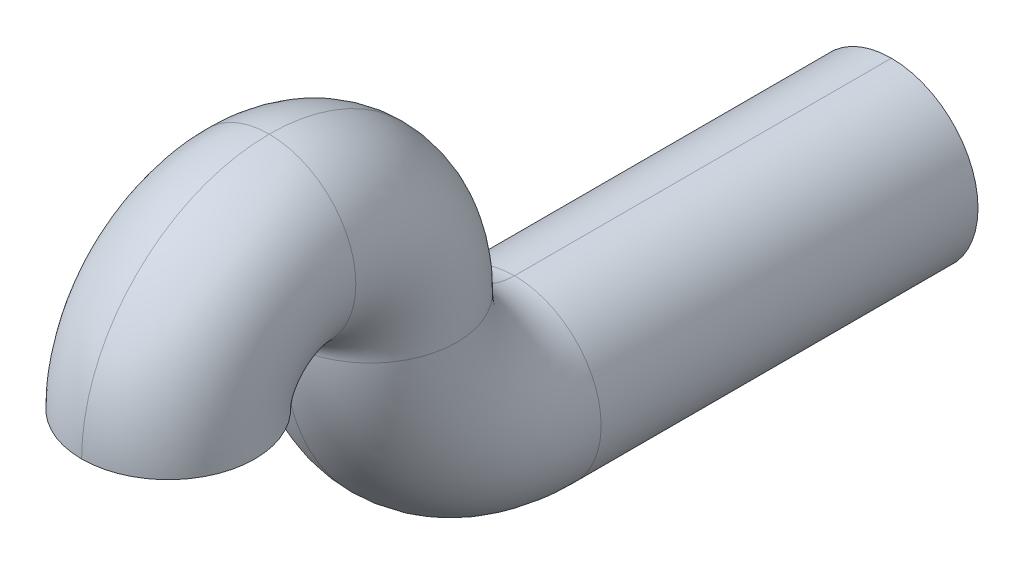
ISO-10303-21;
HEADER;
FILE_DESCRIPTION(('STEP AP214'),'2;1');
FILE_NAME('part.step','',(''),(''),'','','');
FILE_SCHEMA(('AUTOMOTIVE_DESIGN { 1 0 10303 214 1 1 1 1 }'));
ENDSEC;
DATA;
#1=APPLICATION_CONTEXT('core data for automotive mechanical design processes');
#2=APPLICATION_PROTOCOL_DEFINITION('international standard','automotive_design',2000,#1);
#3=PRODUCT_CONTEXT('',#1,'mechanical');
#4=PRODUCT('Part','Part','',(#3));
#5=PRODUCT_RELATED_PRODUCT_CATEGORY('part','',(#4));
#6=PRODUCT_DEFINITION_FORMATION('','',#4);
#7=PRODUCT_DEFINITION_CONTEXT('part definition',#1,'design');
#8=PRODUCT_DEFINITION('design','',#6,#7);
#9=PRODUCT_DEFINITION_SHAPE('','',#8);
#10=(LENGTH_UNIT() NAMED_UNIT(*) SI_UNIT(.MILLI.,.METRE.));
#11=(NAMED_UNIT(*) PLANE_ANGLE_UNIT() SI_UNIT($,.RADIAN.));
#12=(NAMED_UNIT(*) SI_UNIT($,.STERADIAN.) SOLID_ANGLE_UNIT());
#13=UNCERTAINTY_MEASURE_WITH_UNIT(LENGTH_MEASURE(1.E-05),#10,'distance_accuracy_value','');
#14=(GEOMETRIC_REPRESENTATION_CONTEXT(3) GLOBAL_UNCERTAINTY_ASSIGNED_CONTEXT((#13)) GLOBAL_UNIT_ASSIGNED_CONTEXT((#10,
#11,#12)) REPRESENTATION_CONTEXT('',''));
#15=CARTESIAN_POINT('',(0.,0.,0.));
#16=DIRECTION('',(0.,0.,1.));
#17=DIRECTION('',(1.,0.,0.));
#18=AXIS2_PLACEMENT_3D('',#15,#16,#17);
#19=CARTESIAN_POINT('',(100.,120.046296296296,120.));
#20=DIRECTION('',(0.,0.,1.));
#21=DIRECTION('',(0.,-1.,0.));
#22=AXIS2_PLACEMENT_3D('',#19,#20,#21);
#23=CYLINDRICAL_SURFACE('',#22,20.);
#24=DIRECTION('',(0.,0.,1.));
#25=VECTOR('',#24,1.);
#26=CARTESIAN_POINT('',(100.,140.046296296296,120.));
#27=LINE('',#26,#25);
#28=CARTESIAN_POINT('',(100.,140.046296296296,120.));
#29=VERTEX_POINT('',#28);
#30=CARTESIAN_POINT('',(100.,140.046296296296,250.573265730801));
#31=VERTEX_POINT('',#30);
#32=EDGE_CURVE('E158',#29,#31,#27,.T.);
#33=ORIENTED_EDGE('',*,*,#32,.F.);
#34=CARTESIAN_POINT('',(100.,120.046296296296,120.));
#35=DIRECTION('',(0.,0.,1.));
#36=DIRECTION('',(1.,0.,0.));
#37=AXIS2_PLACEMENT_3D('',#34,#35,#36);
#38=CIRCLE('',#37,20.);
#39=CARTESIAN_POINT('',(100.,100.046296296296,120.));
#40=VERTEX_POINT('',#39);
#41=EDGE_CURVE('E10',#40,#29,#38,.T.);
#42=ORIENTED_EDGE('',*,*,#41,.F.);
#43=DIRECTION('',(0.,0.,1.));
#44=VECTOR('',#43,1.);
#45=CARTESIAN_POINT('',(100.,100.046296296296,120.));
#46=LINE('',#45,#44);
#47=CARTESIAN_POINT('',(100.,100.046296296296,250.573265730801));
#48=VERTEX_POINT('',#47);
#49=EDGE_CURVE('E214',#40,#48,#46,.T.);
#50=ORIENTED_EDGE('',*,*,#49,.T.);
#51=CARTESIAN_POINT('',(100.,120.046296296296,250.573265730801));
#52=DIRECTION('',(0.,0.,1.));
#53=DIRECTION('',(-1.,0.,0.));
#54=AXIS2_PLACEMENT_3D('',#51,#52,#53);
#55=CIRCLE('',#54,20.);
#56=EDGE_CURVE('E173',#48,#31,#55,.T.);
#57=ORIENTED_EDGE('',*,*,#56,.T.);
#58=EDGE_LOOP('',(#33,#42,#50,#57));
#59=FACE_BOUND('',#58,.T.);
#60=ADVANCED_FACE('F16',(#59),#23,.F.);
#61=CARTESIAN_POINT('',(100.,170.046296296297,250.573265730801));
#62=DIRECTION('',(-1.,0.,0.));
#63=DIRECTION('',(0.,-1.,0.));
#64=AXIS2_PLACEMENT_3D('',#61,#62,#63);
#65=TOROIDAL_SURFACE('',#64,50.,20.);
#66=CARTESIAN_POINT('',(100.,170.046296296297,250.573265730801));
#67=DIRECTION('',(-1.,0.,0.));
#68=DIRECTION('',(0.,-1.,0.));
#69=AXIS2_PLACEMENT_3D('',#66,#67,#68);
#70=CIRCLE('',#69,70.);
#71=CARTESIAN_POINT('',(100.,170.046296296297,320.573265730801));
#72=VERTEX_POINT('',#71);
#73=EDGE_CURVE('E168',#48,#72,#70,.T.);
#74=ORIENTED_EDGE('',*,*,#73,.F.);
#75=CARTESIAN_POINT('',(100.,120.046296296296,250.573265730801));
#76=DIRECTION('',(0.,0.,1.));
#77=DIRECTION('',(-1.,0.,0.));
#78=AXIS2_PLACEMENT_3D('',#75,#76,#77);
#79=CIRCLE('',#78,20.);
#80=EDGE_CURVE('E210',#31,#48,#79,.T.);
#81=ORIENTED_EDGE('',*,*,#80,.F.);
#82=CARTESIAN_POINT('',(100.,170.046296296297,250.573265730801));
#83=DIRECTION('',(-1.,0.,0.));
#84=DIRECTION('',(0.,-1.,0.));
#85=AXIS2_PLACEMENT_3D('',#82,#83,#84);
#86=CIRCLE('',#85,30.);
#87=CARTESIAN_POINT('',(100.,170.046296296297,280.573265730801));
#88=VERTEX_POINT('',#87);
#89=EDGE_CURVE('E198',#31,#88,#86,.T.);
#90=ORIENTED_EDGE('',*,*,#89,.T.);
#91=CARTESIAN_POINT('',(100.,170.046296296297,300.573265730801));
#92=DIRECTION('',(0.,1.,0.));
#93=DIRECTION('',(0.,0.,-1.));
#94=AXIS2_PLACEMENT_3D('',#91,#92,#93);
#95=CIRCLE('',#94,20.);
#96=EDGE_CURVE('E242',#88,#72,#95,.T.);
#97=ORIENTED_EDGE('',*,*,#96,.T.);
#98=EDGE_LOOP('',(#74,#81,#90,#97));
#99=FACE_BOUND('',#98,.T.);
#100=ADVANCED_FACE('F390',(#99),#65,.F.);
#101=CARTESIAN_POINT('',(100.,170.046296296296,335.573265730801));
#102=DIRECTION('',(1.,0.,0.));
#103=DIRECTION('',(0.,1.,0.));
#104=AXIS2_PLACEMENT_3D('',#101,#102,#103);
#105=TOROIDAL_SURFACE('',#104,35.,20.);
#106=CARTESIAN_POINT('',(100.,170.046296296296,335.573265730801));
#107=DIRECTION('',(1.,0.,0.));
#108=DIRECTION('',(0.,1.,0.));
#109=AXIS2_PLACEMENT_3D('',#106,#107,#108);
#110=CIRCLE('',#109,55.);
#111=CARTESIAN_POINT('',(100.,225.046296296296,335.573265730801));
#112=VERTEX_POINT('',#111);
#113=EDGE_CURVE('E164',#88,#112,#110,.T.);
#114=ORIENTED_EDGE('',*,*,#113,.F.);
#115=CARTESIAN_POINT('',(100.,170.046296296297,300.573265730801));
#116=DIRECTION('',(0.,1.,0.));
#117=DIRECTION('',(0.,0.,-1.));
#118=AXIS2_PLACEMENT_3D('',#115,#116,#117);
#119=CIRCLE('',#118,20.);
#120=EDGE_CURVE('E172',#72,#88,#119,.T.);
#121=ORIENTED_EDGE('',*,*,#120,.F.);
#122=CARTESIAN_POINT('',(100.,170.046296296296,335.573265730801));
#123=DIRECTION('',(1.,0.,0.));
#124=DIRECTION('',(0.,1.,0.));
#125=AXIS2_PLACEMENT_3D('',#122,#123,#124);
#126=CIRCLE('',#125,15.);
#127=CARTESIAN_POINT('',(100.,185.046296296296,335.573265730801));
#128=VERTEX_POINT('',#127);
#129=EDGE_CURVE('E163',#72,#128,#126,.T.);
#130=ORIENTED_EDGE('',*,*,#129,.T.);
#131=CARTESIAN_POINT('',(100.,205.046296296296,335.573265730801));
#132=DIRECTION('',(0.,0.,-1.));
#133=DIRECTION('',(-1.,0.,0.));
#134=AXIS2_PLACEMENT_3D('',#131,#132,#133);
#135=CIRCLE('',#134,20.);
#136=EDGE_CURVE('E179',#112,#128,#135,.T.);
#137=ORIENTED_EDGE('',*,*,#136,.F.);
#138=EDGE_LOOP('',(#114,#121,#130,#137));
#139=FACE_BOUND('',#138,.T.);
#140=ADVANCED_FACE('F407',(#139),#105,.F.);
#141=CARTESIAN_POINT('',(100.,120.046296296296,120.));
#142=DIRECTION('',(0.,0.,1.));
#143=DIRECTION('',(1.,0.,0.));
#144=AXIS2_PLACEMENT_3D('',#141,#142,#143);
#145=PLANE('',#144);
#146=ORIENTED_EDGE('',*,*,#41,.T.);
#147=CARTESIAN_POINT('',(100.,120.046296296296,120.));
#148=DIRECTION('',(0.,0.,1.));
#149=DIRECTION('',(1.,0.,0.));
#150=AXIS2_PLACEMENT_3D('',#147,#148,#149);
#151=CIRCLE('',#150,20.);
#152=EDGE_CURVE('E187',#29,#40,#151,.T.);
#153=ORIENTED_EDGE('',*,*,#152,.T.);
#154=EDGE_LOOP('',(#146,#153));
#155=FACE_BOUND('',#154,.T.);
#156=CARTESIAN_POINT('',(100.,120.046296296296,120.));
#157=DIRECTION('',(0.,0.,1.));
#158=DIRECTION('',(1.,0.,0.));
#159=AXIS2_PLACEMENT_3D('',#156,#157,#158);
#160=CIRCLE('',#159,30.);
#161=CARTESIAN_POINT('',(100.,90.0462962962963,120.));
#162=VERTEX_POINT('',#161);
#163=CARTESIAN_POINT('',(100.,150.046296296297,120.));
#164=VERTEX_POINT('',#163);
#165=EDGE_CURVE('E130',#162,#164,#160,.T.);
#166=ORIENTED_EDGE('',*,*,#165,.F.);
#167=CARTESIAN_POINT('',(100.,120.046296296296,120.));
#168=DIRECTION('',(0.,0.,1.));
#169=DIRECTION('',(1.,0.,0.));
#170=AXIS2_PLACEMENT_3D('',#167,#168,#169);
#171=CIRCLE('',#170,30.);
#172=EDGE_CURVE('E27',#164,#162,#171,.T.);
#173=ORIENTED_EDGE('',*,*,#172,.F.);
#174=EDGE_LOOP('',(#166,#173));
#175=FACE_BOUND('',#174,.T.);
#176=ADVANCED_FACE('F403',(#155,#175),#145,.F.);
#177=CARTESIAN_POINT('',(100.,170.046296296297,370.573265730801));
#178=DIRECTION('',(0.,-1.,0.));
#179=DIRECTION('',(-1.,0.,0.));
#180=AXIS2_PLACEMENT_3D('',#177,#178,#179);
#181=PLANE('',#180);
#182=CARTESIAN_POINT('',(100.,170.046296296297,370.573265730801));
#183=DIRECTION('',(0.,-1.,0.));
#184=DIRECTION('',(0.,0.,-1.));
#185=AXIS2_PLACEMENT_3D('',#182,#183,#184);
#186=CIRCLE('',#185,20.);
#187=CARTESIAN_POINT('',(100.,170.046296296297,350.573265730801));
#188=VERTEX_POINT('',#187);
#189=CARTESIAN_POINT('',(100.,170.046296296297,390.573265730801));
#190=VERTEX_POINT('',#189);
#191=EDGE_CURVE('E182',#188,#190,#186,.T.);
#192=ORIENTED_EDGE('',*,*,#191,.F.);
#193=CARTESIAN_POINT('',(100.,170.046296296297,370.573265730801));
#194=DIRECTION('',(0.,-1.,0.));
#195=DIRECTION('',(0.,0.,-1.));
#196=AXIS2_PLACEMENT_3D('',#193,#194,#195);
#197=CIRCLE('',#196,20.);
#198=EDGE_CURVE('E20',#190,#188,#197,.T.);
#199=ORIENTED_EDGE('',*,*,#198,.F.);
#200=EDGE_LOOP('',(#192,#199));
#201=FACE_BOUND('',#200,.T.);
#202=CARTESIAN_POINT('',(100.,170.046296296297,370.573265730801));
#203=DIRECTION('',(0.,-1.,0.));
#204=DIRECTION('',(1.,0.,0.));
#205=AXIS2_PLACEMENT_3D('',#202,#203,#204);
#206=CIRCLE('',#205,30.);
#207=CARTESIAN_POINT('',(100.,170.046296296297,340.573265730801));
#208=VERTEX_POINT('',#207);
#209=CARTESIAN_POINT('',(100.,170.046296296297,400.573265730801));
#210=VERTEX_POINT('',#209);
#211=EDGE_CURVE('E154',#208,#210,#206,.T.);
#212=ORIENTED_EDGE('',*,*,#211,.T.);
#213=CARTESIAN_POINT('',(100.,170.046296296297,370.573265730801));
#214=DIRECTION('',(0.,-1.,0.));
#215=DIRECTION('',(1.,0.,0.));
#216=AXIS2_PLACEMENT_3D('',#213,#214,#215);
#217=CIRCLE('',#216,30.);
#218=EDGE_CURVE('E165',#210,#208,#217,.T.);
#219=ORIENTED_EDGE('',*,*,#218,.T.);
#220=EDGE_LOOP('',(#212,#219));
#221=FACE_BOUND('',#220,.T.);
#222=ADVANCED_FACE('F18',(#201,#221),#181,.T.);
#223=CARTESIAN_POINT('',(100.,120.046296296296,120.));
#224=DIRECTION('',(0.,0.,1.));
#225=DIRECTION('',(0.,-1.,0.));
#226=AXIS2_PLACEMENT_3D('',#223,#224,#225);
#227=CYLINDRICAL_SURFACE('',#226,30.);
#228=DIRECTION('',(0.,0.,1.));
#229=VECTOR('',#228,1.);
#230=CARTESIAN_POINT('',(100.,150.046296296297,120.));
#231=LINE('',#230,#229);
#232=CARTESIAN_POINT('',(100.,150.046296296296,250.573265730801));
#233=VERTEX_POINT('',#232);
#234=EDGE_CURVE('E126',#164,#233,#231,.T.);
#235=ORIENTED_EDGE('',*,*,#234,.F.);
#236=ORIENTED_EDGE('',*,*,#172,.T.);
#237=DIRECTION('',(0.,0.,1.));
#238=VECTOR('',#237,1.);
#239=CARTESIAN_POINT('',(100.,90.0462962962963,120.));
#240=LINE('',#239,#238);
#241=CARTESIAN_POINT('',(100.,90.0462962962963,250.573265730801));
#242=VERTEX_POINT('',#241);
#243=EDGE_CURVE('E125',#162,#242,#240,.T.);
#244=ORIENTED_EDGE('',*,*,#243,.T.);
#245=CARTESIAN_POINT('',(100.,120.046296296296,250.573265730801));
#246=DIRECTION('',(0.,0.,1.));
#247=DIRECTION('',(1.,0.,0.));
#248=AXIS2_PLACEMENT_3D('',#245,#246,#247);
#249=CIRCLE('',#248,30.);
#250=EDGE_CURVE('E137',#233,#242,#249,.T.);
#251=ORIENTED_EDGE('',*,*,#250,.F.);
#252=EDGE_LOOP('',(#235,#236,#244,#251));
#253=FACE_BOUND('',#252,.T.);
#254=ADVANCED_FACE('F143',(#253),#227,.T.);
#255=CARTESIAN_POINT('',(100.,170.046296296297,250.573265730801));
#256=DIRECTION('',(-1.,0.,0.));
#257=DIRECTION('',(0.,-1.,0.));
#258=AXIS2_PLACEMENT_3D('',#255,#256,#257);
#259=TOROIDAL_SURFACE('',#258,50.,30.);
#260=CARTESIAN_POINT('',(100.,170.046296296297,250.573265730801));
#261=DIRECTION('',(-1.,0.,0.));
#262=DIRECTION('',(0.,-1.,0.));
#263=AXIS2_PLACEMENT_3D('',#260,#261,#262);
#264=CIRCLE('',#263,80.);
#265=CARTESIAN_POINT('',(100.,170.046296296297,330.573265730801));
#266=VERTEX_POINT('',#265);
#267=EDGE_CURVE('E120',#242,#266,#264,.T.);
#268=ORIENTED_EDGE('',*,*,#267,.F.);
#269=CARTESIAN_POINT('',(100.,120.046296296296,250.573265730801));
#270=DIRECTION('',(0.,0.,1.));
#271=DIRECTION('',(1.,0.,0.));
#272=AXIS2_PLACEMENT_3D('',#269,#270,#271);
#273=CIRCLE('',#272,30.);
#274=EDGE_CURVE('E112',#242,#233,#273,.T.);
#275=ORIENTED_EDGE('',*,*,#274,.T.);
#276=CARTESIAN_POINT('',(100.,170.046296296297,250.573265730801));
#277=DIRECTION('',(-1.,0.,0.));
#278=DIRECTION('',(0.,-1.,0.));
#279=AXIS2_PLACEMENT_3D('',#276,#277,#278);
#280=CIRCLE('',#279,20.);
#281=CARTESIAN_POINT('',(100.,170.046296296297,270.573265730801));
#282=VERTEX_POINT('',#281);
#283=EDGE_CURVE('E117',#233,#282,#280,.T.);
#284=ORIENTED_EDGE('',*,*,#283,.T.);
#285=CARTESIAN_POINT('',(100.,170.046296296297,300.573265730801));
#286=DIRECTION('',(0.,1.,0.));
#287=DIRECTION('',(1.,0.,0.));
#288=AXIS2_PLACEMENT_3D('',#285,#286,#287);
#289=CIRCLE('',#288,30.);
#290=EDGE_CURVE('E141',#266,#282,#289,.T.);
#291=ORIENTED_EDGE('',*,*,#290,.F.);
#292=EDGE_LOOP('',(#268,#275,#284,#291));
#293=FACE_BOUND('',#292,.T.);
#294=ADVANCED_FACE('F114',(#293),#259,.T.);
#295=CARTESIAN_POINT('',(100.,170.046296296296,335.573265730801));
#296=DIRECTION('',(1.,0.,0.));
#297=DIRECTION('',(0.,1.,0.));
#298=AXIS2_PLACEMENT_3D('',#295,#296,#297);
#299=TOROIDAL_SURFACE('',#298,35.,30.);
#300=CARTESIAN_POINT('',(100.,170.046296296296,335.573265730801));
#301=DIRECTION('',(1.,0.,0.));
#302=DIRECTION('',(0.,1.,0.));
#303=AXIS2_PLACEMENT_3D('',#300,#301,#302);
#304=CIRCLE('',#303,65.);
#305=CARTESIAN_POINT('',(100.,235.046296296296,335.573265730801));
#306=VERTEX_POINT('',#305);
#307=EDGE_CURVE('E197',#306,#210,#304,.T.);
#308=ORIENTED_EDGE('',*,*,#307,.F.);
#309=CARTESIAN_POINT('',(100.,205.046296296296,335.573265730801));
#310=DIRECTION('',(0.,0.,-1.));
#311=DIRECTION('',(-1.,0.,0.));
#312=AXIS2_PLACEMENT_3D('',#309,#310,#311);
#313=CIRCLE('',#312,30.);
#314=CARTESIAN_POINT('',(100.,175.046296296296,335.573265730801));
#315=VERTEX_POINT('',#314);
#316=EDGE_CURVE('E186',#315,#306,#313,.T.);
#317=ORIENTED_EDGE('',*,*,#316,.F.);
#318=CARTESIAN_POINT('',(100.,170.046296296296,335.573265730801));
#319=DIRECTION('',(1.,0.,0.));
#320=DIRECTION('',(0.,1.,0.));
#321=AXIS2_PLACEMENT_3D('',#318,#319,#320);
#322=CIRCLE('',#321,5.);
#323=EDGE_CURVE('E145',#315,#208,#322,.T.);
#324=ORIENTED_EDGE('',*,*,#323,.T.);
#325=ORIENTED_EDGE('',*,*,#218,.F.);
#326=EDGE_LOOP('',(#308,#317,#324,#325));
#327=FACE_BOUND('',#326,.T.);
#328=ADVANCED_FACE('F398',(#327),#299,.T.);
#329=CARTESIAN_POINT('',(100.,120.046296296296,120.));
#330=DIRECTION('',(0.,0.,1.));
#331=DIRECTION('',(0.,-1.,0.));
#332=AXIS2_PLACEMENT_3D('',#329,#330,#331);
#333=CYLINDRICAL_SURFACE('',#332,30.);
#334=ORIENTED_EDGE('',*,*,#165,.T.);
#335=ORIENTED_EDGE('',*,*,#234,.T.);
#336=ORIENTED_EDGE('',*,*,#274,.F.);
#337=ORIENTED_EDGE('',*,*,#243,.F.);
#338=EDGE_LOOP('',(#334,#335,#336,#337));
#339=FACE_BOUND('',#338,.T.);
#340=ADVANCED_FACE('F129',(#339),#333,.T.);
#341=CARTESIAN_POINT('',(100.,170.046296296296,335.573265730801));
#342=DIRECTION('',(1.,0.,0.));
#343=DIRECTION('',(0.,1.,0.));
#344=AXIS2_PLACEMENT_3D('',#341,#342,#343);
#345=TOROIDAL_SURFACE('',#344,35.,30.);
#346=CARTESIAN_POINT('',(100.,170.046296296296,335.573265730801));
#347=DIRECTION('',(1.,0.,0.));
#348=DIRECTION('',(0.,1.,0.));
#349=AXIS2_PLACEMENT_3D('',#346,#347,#348);
#350=CIRCLE('',#349,65.);
#351=EDGE_CURVE('E238',#282,#306,#350,.T.);
#352=ORIENTED_EDGE('',*,*,#351,.F.);
#353=CARTESIAN_POINT('',(100.,170.046296296297,300.573265730801));
#354=DIRECTION('',(0.,1.,0.));
#355=DIRECTION('',(1.,0.,0.));
#356=AXIS2_PLACEMENT_3D('',#353,#354,#355);
#357=CIRCLE('',#356,30.);
#358=EDGE_CURVE('E139',#282,#266,#357,.T.);
#359=ORIENTED_EDGE('',*,*,#358,.T.);
#360=CARTESIAN_POINT('',(100.,170.046296296296,335.573265730801));
#361=DIRECTION('',(1.,0.,0.));
#362=DIRECTION('',(0.,1.,0.));
#363=AXIS2_PLACEMENT_3D('',#360,#361,#362);
#364=CIRCLE('',#363,5.);
#365=EDGE_CURVE('E178',#266,#315,#364,.T.);
#366=ORIENTED_EDGE('',*,*,#365,.T.);
#367=ORIENTED_EDGE('',*,*,#316,.T.);
#368=EDGE_LOOP('',(#352,#359,#366,#367));
#369=FACE_BOUND('',#368,.T.);
#370=ADVANCED_FACE('F416',(#369),#345,.T.);
#371=CARTESIAN_POINT('',(100.,120.046296296296,120.));
#372=DIRECTION('',(0.,0.,1.));
#373=DIRECTION('',(0.,-1.,0.));
#374=AXIS2_PLACEMENT_3D('',#371,#372,#373);
#375=CYLINDRICAL_SURFACE('',#374,20.);
#376=ORIENTED_EDGE('',*,*,#152,.F.);
#377=ORIENTED_EDGE('',*,*,#32,.T.);
#378=ORIENTED_EDGE('',*,*,#80,.T.);
#379=ORIENTED_EDGE('',*,*,#49,.F.);
#380=EDGE_LOOP('',(#376,#377,#378,#379));
#381=FACE_BOUND('',#380,.T.);
#382=ADVANCED_FACE('F432',(#381),#375,.F.);
#383=CARTESIAN_POINT('',(100.,170.046296296296,335.573265730801));
#384=DIRECTION('',(1.,0.,0.));
#385=DIRECTION('',(0.,1.,0.));
#386=AXIS2_PLACEMENT_3D('',#383,#384,#385);
#387=TOROIDAL_SURFACE('',#386,35.,20.);
#388=CARTESIAN_POINT('',(100.,170.046296296296,335.573265730801));
#389=DIRECTION('',(1.,0.,0.));
#390=DIRECTION('',(0.,1.,0.));
#391=AXIS2_PLACEMENT_3D('',#388,#389,#390);
#392=CIRCLE('',#391,55.);
#393=EDGE_CURVE('E174',#112,#190,#392,.T.);
#394=ORIENTED_EDGE('',*,*,#393,.F.);
#395=ORIENTED_EDGE('',*,*,#136,.T.);
#396=CARTESIAN_POINT('',(100.,170.046296296296,335.573265730801));
#397=DIRECTION('',(1.,0.,0.));
#398=DIRECTION('',(0.,1.,0.));
#399=AXIS2_PLACEMENT_3D('',#396,#397,#398);
#400=CIRCLE('',#399,15.);
#401=EDGE_CURVE('E183',#128,#188,#400,.T.);
#402=ORIENTED_EDGE('',*,*,#401,.T.);
#403=ORIENTED_EDGE('',*,*,#191,.T.);
#404=EDGE_LOOP('',(#394,#395,#402,#403));
#405=FACE_BOUND('',#404,.T.);
#406=ADVANCED_FACE('F262',(#405),#387,.F.);
#407=CARTESIAN_POINT('',(100.,170.046296296296,335.573265730801));
#408=DIRECTION('',(1.,0.,0.));
#409=DIRECTION('',(0.,1.,0.));
#410=AXIS2_PLACEMENT_3D('',#407,#408,#409);
#411=TOROIDAL_SURFACE('',#410,35.,20.);
#412=CARTESIAN_POINT('',(100.,205.046296296296,335.573265730801));
#413=DIRECTION('',(0.,0.,-1.));
#414=DIRECTION('',(-1.,0.,0.));
#415=AXIS2_PLACEMENT_3D('',#412,#413,#414);
#416=CIRCLE('',#415,20.);
#417=EDGE_CURVE('E160',#128,#112,#416,.T.);
#418=ORIENTED_EDGE('',*,*,#417,.T.);
#419=ORIENTED_EDGE('',*,*,#393,.T.);
#420=ORIENTED_EDGE('',*,*,#198,.T.);
#421=ORIENTED_EDGE('',*,*,#401,.F.);
#422=EDGE_LOOP('',(#418,#419,#420,#421));
#423=FACE_BOUND('',#422,.T.);
#424=ADVANCED_FACE('F269',(#423),#411,.F.);
#425=CARTESIAN_POINT('',(100.,170.046296296296,335.573265730801));
#426=DIRECTION('',(1.,0.,0.));
#427=DIRECTION('',(0.,1.,0.));
#428=AXIS2_PLACEMENT_3D('',#425,#426,#427);
#429=TOROIDAL_SURFACE('',#428,35.,30.);
#430=ORIENTED_EDGE('',*,*,#290,.T.);
#431=ORIENTED_EDGE('',*,*,#351,.T.);
#432=CARTESIAN_POINT('',(100.,205.046296296296,335.573265730801));
#433=DIRECTION('',(0.,0.,-1.));
#434=DIRECTION('',(-1.,0.,0.));
#435=AXIS2_PLACEMENT_3D('',#432,#433,#434);
#436=CIRCLE('',#435,30.);
#437=EDGE_CURVE('E193',#306,#315,#436,.T.);
#438=ORIENTED_EDGE('',*,*,#437,.T.);
#439=ORIENTED_EDGE('',*,*,#365,.F.);
#440=EDGE_LOOP('',(#430,#431,#438,#439));
#441=FACE_BOUND('',#440,.T.);
#442=ADVANCED_FACE('F471',(#441),#429,.T.);
#443=CARTESIAN_POINT('',(100.,170.046296296297,250.573265730801));
#444=DIRECTION('',(-1.,0.,0.));
#445=DIRECTION('',(0.,-1.,0.));
#446=AXIS2_PLACEMENT_3D('',#443,#444,#445);
#447=TOROIDAL_SURFACE('',#446,50.,30.);
#448=ORIENTED_EDGE('',*,*,#250,.T.);
#449=ORIENTED_EDGE('',*,*,#267,.T.);
#450=ORIENTED_EDGE('',*,*,#358,.F.);
#451=ORIENTED_EDGE('',*,*,#283,.F.);
#452=EDGE_LOOP('',(#448,#449,#450,#451));
#453=FACE_BOUND('',#452,.T.);
#454=ADVANCED_FACE('F136',(#453),#447,.T.);
#455=CARTESIAN_POINT('',(100.,170.046296296296,335.573265730801));
#456=DIRECTION('',(1.,0.,0.));
#457=DIRECTION('',(0.,1.,0.));
#458=AXIS2_PLACEMENT_3D('',#455,#456,#457);
#459=TOROIDAL_SURFACE('',#458,35.,30.);
#460=ORIENTED_EDGE('',*,*,#437,.F.);
#461=ORIENTED_EDGE('',*,*,#307,.T.);
#462=ORIENTED_EDGE('',*,*,#211,.F.);
#463=ORIENTED_EDGE('',*,*,#323,.F.);
#464=EDGE_LOOP('',(#460,#461,#462,#463));
#465=FACE_BOUND('',#464,.T.);
#466=ADVANCED_FACE('F437',(#465),#459,.T.);
#467=CARTESIAN_POINT('',(100.,170.046296296297,250.573265730801));
#468=DIRECTION('',(-1.,0.,0.));
#469=DIRECTION('',(0.,-1.,0.));
#470=AXIS2_PLACEMENT_3D('',#467,#468,#469);
#471=TOROIDAL_SURFACE('',#470,50.,20.);
#472=ORIENTED_EDGE('',*,*,#56,.F.);
#473=ORIENTED_EDGE('',*,*,#73,.T.);
#474=ORIENTED_EDGE('',*,*,#120,.T.);
#475=ORIENTED_EDGE('',*,*,#89,.F.);
#476=EDGE_LOOP('',(#472,#473,#474,#475));
#477=FACE_BOUND('',#476,.T.);
#478=ADVANCED_FACE('F441',(#477),#471,.F.);
#479=CARTESIAN_POINT('',(100.,170.046296296296,335.573265730801));
#480=DIRECTION('',(1.,0.,0.));
#481=DIRECTION('',(0.,1.,0.));
#482=AXIS2_PLACEMENT_3D('',#479,#480,#481);
#483=TOROIDAL_SURFACE('',#482,35.,20.);
#484=ORIENTED_EDGE('',*,*,#96,.F.);
#485=ORIENTED_EDGE('',*,*,#113,.T.);
#486=ORIENTED_EDGE('',*,*,#417,.F.);
#487=ORIENTED_EDGE('',*,*,#129,.F.);
#488=EDGE_LOOP('',(#484,#485,#486,#487));
#489=FACE_BOUND('',#488,.T.);
#490=ADVANCED_FACE('F276',(#489),#483,.F.);
#491=CLOSED_SHELL('',(#60,#100,#140,#176,#222,#254,#294,#328,#340,#370,#382,#406,#424,#442,#454,
#466,#478,#490));
#492=MANIFOLD_SOLID_BREP('B1',#491);
#493=ADVANCED_BREP_SHAPE_REPRESENTATION('',(#18,#492),#14);
#494=SHAPE_DEFINITION_REPRESENTATION(#9,#493);
ENDSEC;
END-ISO-10303-21;
